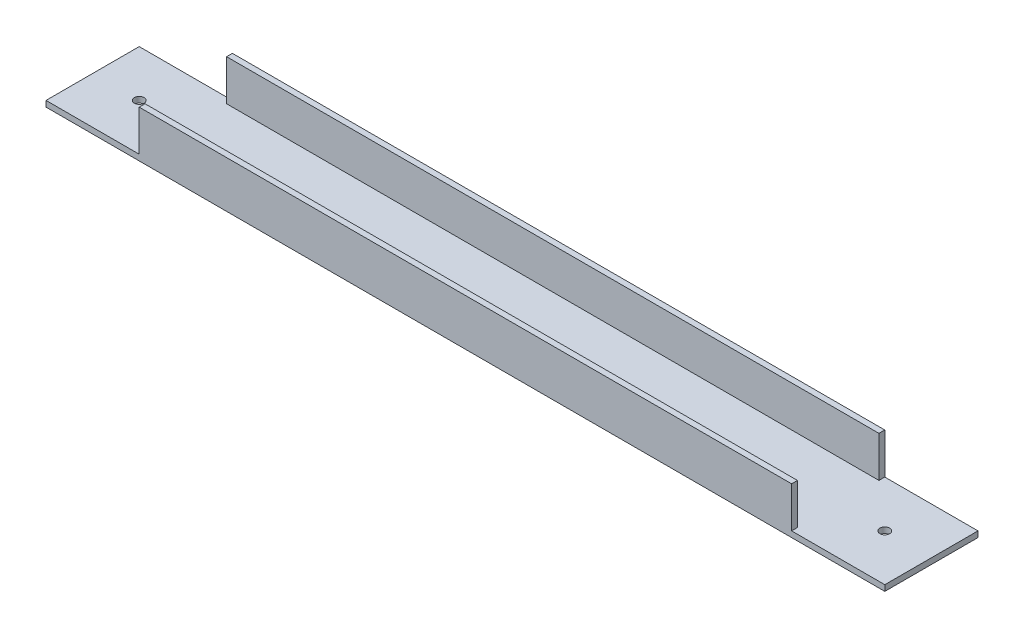
ISO-10303-21;
HEADER;
FILE_DESCRIPTION(('STEP AP214'),'2;1');
FILE_NAME('part.step','',(''),(''),'','','');
FILE_SCHEMA(('AUTOMOTIVE_DESIGN { 1 0 10303 214 1 1 1 1 }'));
ENDSEC;
DATA;
#1=APPLICATION_CONTEXT('core data for automotive mechanical design processes');
#2=APPLICATION_PROTOCOL_DEFINITION('international standard','automotive_design',2000,#1);
#3=PRODUCT_CONTEXT('',#1,'mechanical');
#4=PRODUCT('Part','Part','',(#3));
#5=PRODUCT_RELATED_PRODUCT_CATEGORY('part','',(#4));
#6=PRODUCT_DEFINITION_FORMATION('','',#4);
#7=PRODUCT_DEFINITION_CONTEXT('part definition',#1,'design');
#8=PRODUCT_DEFINITION('design','',#6,#7);
#9=PRODUCT_DEFINITION_SHAPE('','',#8);
#10=(LENGTH_UNIT() NAMED_UNIT(*) SI_UNIT(.MILLI.,.METRE.));
#11=(NAMED_UNIT(*) PLANE_ANGLE_UNIT() SI_UNIT($,.RADIAN.));
#12=(NAMED_UNIT(*) SI_UNIT($,.STERADIAN.) SOLID_ANGLE_UNIT());
#13=UNCERTAINTY_MEASURE_WITH_UNIT(LENGTH_MEASURE(1.E-05),#10,'distance_accuracy_value','');
#14=(GEOMETRIC_REPRESENTATION_CONTEXT(3) GLOBAL_UNCERTAINTY_ASSIGNED_CONTEXT((#13)) GLOBAL_UNIT_ASSIGNED_CONTEXT((#10,
#11,#12)) REPRESENTATION_CONTEXT('',''));
#15=CARTESIAN_POINT('',(0.,0.,0.));
#16=DIRECTION('',(0.,0.,1.));
#17=DIRECTION('',(1.,0.,0.));
#18=AXIS2_PLACEMENT_3D('',#15,#16,#17);
#19=CARTESIAN_POINT('',(457.2,0.,0.));
#20=DIRECTION('',(0.,0.,-1.));
#21=DIRECTION('',(-1.,0.,0.));
#22=AXIS2_PLACEMENT_3D('',#19,#20,#21);
#23=PLANE('',#22);
#24=DIRECTION('',(0.,1.,0.));
#25=VECTOR('',#24,1.);
#26=CARTESIAN_POINT('',(50.8,-68.6670489685532,0.));
#27=LINE('',#26,#25);
#28=CARTESIAN_POINT('',(50.8,3.17499999999997,0.));
#29=VERTEX_POINT('',#28);
#30=CARTESIAN_POINT('',(50.8,25.4,0.));
#31=VERTEX_POINT('',#30);
#32=EDGE_CURVE('E124',#29,#31,#27,.T.);
#33=ORIENTED_EDGE('',*,*,#32,.F.);
#34=DIRECTION('',(1.,0.,0.));
#35=VECTOR('',#34,1.);
#36=CARTESIAN_POINT('',(0.,3.175,0.));
#37=LINE('',#36,#35);
#38=CARTESIAN_POINT('',(0.,3.175,0.));
#39=VERTEX_POINT('',#38);
#40=EDGE_CURVE('E135',#39,#29,#37,.T.);
#41=ORIENTED_EDGE('',*,*,#40,.F.);
#42=DIRECTION('',(0.,-1.,0.));
#43=VECTOR('',#42,1.);
#44=CARTESIAN_POINT('',(0.,0.,0.));
#45=LINE('',#44,#43);
#46=CARTESIAN_POINT('',(0.,0.,0.));
#47=VERTEX_POINT('',#46);
#48=EDGE_CURVE('E176',#39,#47,#45,.T.);
#49=ORIENTED_EDGE('',*,*,#48,.T.);
#50=DIRECTION('',(-1.,0.,0.));
#51=VECTOR('',#50,1.);
#52=CARTESIAN_POINT('',(457.2,0.,0.));
#53=LINE('',#52,#51);
#54=CARTESIAN_POINT('',(457.2,0.,0.));
#55=VERTEX_POINT('',#54);
#56=EDGE_CURVE('E11',#55,#47,#53,.T.);
#57=ORIENTED_EDGE('',*,*,#56,.F.);
#58=DIRECTION('',(0.,-1.,0.));
#59=VECTOR('',#58,1.);
#60=CARTESIAN_POINT('',(457.2,0.,0.));
#61=LINE('',#60,#59);
#62=CARTESIAN_POINT('',(457.2,3.17499999999997,0.));
#63=VERTEX_POINT('',#62);
#64=EDGE_CURVE('E177',#63,#55,#61,.T.);
#65=ORIENTED_EDGE('',*,*,#64,.F.);
#66=DIRECTION('',(1.,0.,0.));
#67=VECTOR('',#66,1.);
#68=CARTESIAN_POINT('',(457.2,3.175,0.));
#69=LINE('',#68,#67);
#70=CARTESIAN_POINT('',(406.4,3.175,0.));
#71=VERTEX_POINT('',#70);
#72=EDGE_CURVE('E155',#71,#63,#69,.T.);
#73=ORIENTED_EDGE('',*,*,#72,.F.);
#74=DIRECTION('',(0.,1.,0.));
#75=VECTOR('',#74,1.);
#76=CARTESIAN_POINT('',(406.4,-68.6670489685532,0.));
#77=LINE('',#76,#75);
#78=CARTESIAN_POINT('',(406.4,25.4,0.));
#79=VERTEX_POINT('',#78);
#80=EDGE_CURVE('E158',#71,#79,#77,.T.);
#81=ORIENTED_EDGE('',*,*,#80,.T.);
#82=DIRECTION('',(-1.,0.,0.));
#83=VECTOR('',#82,1.);
#84=CARTESIAN_POINT('',(457.2,25.4,0.));
#85=LINE('',#84,#83);
#86=EDGE_CURVE('E144',#79,#31,#85,.T.);
#87=ORIENTED_EDGE('',*,*,#86,.T.);
#88=EDGE_LOOP('',(#33,#41,#49,#57,#65,#73,#81,#87));
#89=FACE_BOUND('',#88,.T.);
#90=ADVANCED_FACE('F32',(#89),#23,.F.);
#91=CARTESIAN_POINT('',(457.2,0.,0.));
#92=DIRECTION('',(0.,1.,0.));
#93=DIRECTION('',(0.,0.,1.));
#94=AXIS2_PLACEMENT_3D('',#91,#92,#93);
#95=PLANE('',#94);
#96=CARTESIAN_POINT('',(25.4,0.,-25.4));
#97=DIRECTION('',(0.,-1.,0.));
#98=DIRECTION('',(0.,0.,-1.));
#99=AXIS2_PLACEMENT_3D('',#96,#97,#98);
#100=CIRCLE('',#99,2.667);
#101=CARTESIAN_POINT('',(25.4,0.,-28.067));
#102=VERTEX_POINT('',#101);
#103=EDGE_CURVE('E307',#102,#102,#100,.T.);
#104=ORIENTED_EDGE('',*,*,#103,.F.);
#105=EDGE_LOOP('',(#104));
#106=FACE_BOUND('',#105,.T.);
#107=CARTESIAN_POINT('',(431.8,0.,-25.4));
#108=DIRECTION('',(0.,-1.,0.));
#109=DIRECTION('',(0.,0.,1.));
#110=AXIS2_PLACEMENT_3D('',#107,#108,#109);
#111=CIRCLE('',#110,2.66699999999997);
#112=CARTESIAN_POINT('',(431.8,0.,-22.733));
#113=VERTEX_POINT('',#112);
#114=EDGE_CURVE('E303',#113,#113,#111,.T.);
#115=ORIENTED_EDGE('',*,*,#114,.F.);
#116=EDGE_LOOP('',(#115));
#117=FACE_BOUND('',#116,.T.);
#118=DIRECTION('',(0.,0.,-1.));
#119=VECTOR('',#118,1.);
#120=CARTESIAN_POINT('',(0.,0.,0.));
#121=LINE('',#120,#119);
#122=CARTESIAN_POINT('',(0.,0.,-50.8));
#123=VERTEX_POINT('',#122);
#124=EDGE_CURVE('E185',#47,#123,#121,.T.);
#125=ORIENTED_EDGE('',*,*,#124,.T.);
#126=DIRECTION('',(-1.,0.,0.));
#127=VECTOR('',#126,1.);
#128=CARTESIAN_POINT('',(457.2,0.,-50.8));
#129=LINE('',#128,#127);
#130=CARTESIAN_POINT('',(457.2,0.,-50.8));
#131=VERTEX_POINT('',#130);
#132=EDGE_CURVE('E39',#131,#123,#129,.T.);
#133=ORIENTED_EDGE('',*,*,#132,.F.);
#134=DIRECTION('',(0.,0.,-1.));
#135=VECTOR('',#134,1.);
#136=CARTESIAN_POINT('',(457.2,0.,0.));
#137=LINE('',#136,#135);
#138=EDGE_CURVE('E179',#55,#131,#137,.T.);
#139=ORIENTED_EDGE('',*,*,#138,.F.);
#140=ORIENTED_EDGE('',*,*,#56,.T.);
#141=EDGE_LOOP('',(#125,#133,#139,#140));
#142=FACE_BOUND('',#141,.T.);
#143=ADVANCED_FACE('F216',(#106,#117,#142),#95,.F.);
#144=CARTESIAN_POINT('',(457.2,0.,-50.8));
#145=DIRECTION('',(0.,0.,1.));
#146=DIRECTION('',(1.,0.,0.));
#147=AXIS2_PLACEMENT_3D('',#144,#145,#146);
#148=PLANE('',#147);
#149=DIRECTION('',(0.,1.,0.));
#150=VECTOR('',#149,1.);
#151=CARTESIAN_POINT('',(0.,0.,-50.8));
#152=LINE('',#151,#150);
#153=CARTESIAN_POINT('',(0.,3.17499999999997,-50.8));
#154=VERTEX_POINT('',#153);
#155=EDGE_CURVE('E187',#123,#154,#152,.T.);
#156=ORIENTED_EDGE('',*,*,#155,.T.);
#157=DIRECTION('',(-1.,0.,0.));
#158=VECTOR('',#157,1.);
#159=CARTESIAN_POINT('',(0.,3.175,-50.8));
#160=LINE('',#159,#158);
#161=CARTESIAN_POINT('',(50.8,3.175,-50.8));
#162=VERTEX_POINT('',#161);
#163=EDGE_CURVE('E169',#162,#154,#160,.T.);
#164=ORIENTED_EDGE('',*,*,#163,.F.);
#165=DIRECTION('',(0.,1.,0.));
#166=VECTOR('',#165,1.);
#167=CARTESIAN_POINT('',(50.8,-68.6670489685532,-50.8));
#168=LINE('',#167,#166);
#169=CARTESIAN_POINT('',(50.8,25.4,-50.8));
#170=VERTEX_POINT('',#169);
#171=EDGE_CURVE('E131',#162,#170,#168,.T.);
#172=ORIENTED_EDGE('',*,*,#171,.T.);
#173=DIRECTION('',(-1.,0.,0.));
#174=VECTOR('',#173,1.);
#175=CARTESIAN_POINT('',(457.2,25.4,-50.8));
#176=LINE('',#175,#174);
#177=CARTESIAN_POINT('',(406.4,25.4,-50.8));
#178=VERTEX_POINT('',#177);
#179=EDGE_CURVE('E202',#178,#170,#176,.T.);
#180=ORIENTED_EDGE('',*,*,#179,.F.);
#181=DIRECTION('',(0.,1.,0.));
#182=VECTOR('',#181,1.);
#183=CARTESIAN_POINT('',(406.4,-68.6670489685532,-50.8));
#184=LINE('',#183,#182);
#185=CARTESIAN_POINT('',(406.4,3.17499999999997,-50.8));
#186=VERTEX_POINT('',#185);
#187=EDGE_CURVE('E154',#186,#178,#184,.T.);
#188=ORIENTED_EDGE('',*,*,#187,.F.);
#189=DIRECTION('',(-1.,0.,0.));
#190=VECTOR('',#189,1.);
#191=CARTESIAN_POINT('',(457.2,3.175,-50.8));
#192=LINE('',#191,#190);
#193=CARTESIAN_POINT('',(457.2,3.175,-50.8));
#194=VERTEX_POINT('',#193);
#195=EDGE_CURVE('E150',#194,#186,#192,.T.);
#196=ORIENTED_EDGE('',*,*,#195,.F.);
#197=DIRECTION('',(0.,1.,0.));
#198=VECTOR('',#197,1.);
#199=CARTESIAN_POINT('',(457.2,0.,-50.8));
#200=LINE('',#199,#198);
#201=EDGE_CURVE('E181',#131,#194,#200,.T.);
#202=ORIENTED_EDGE('',*,*,#201,.F.);
#203=ORIENTED_EDGE('',*,*,#132,.T.);
#204=EDGE_LOOP('',(#156,#164,#172,#180,#188,#196,#202,#203));
#205=FACE_BOUND('',#204,.T.);
#206=ADVANCED_FACE('F208',(#205),#148,.F.);
#207=CARTESIAN_POINT('',(457.2,25.4,-50.8));
#208=DIRECTION('',(0.,-1.,0.));
#209=DIRECTION('',(0.,0.,-1.));
#210=AXIS2_PLACEMENT_3D('',#207,#208,#209);
#211=PLANE('',#210);
#212=ORIENTED_EDGE('',*,*,#179,.T.);
#213=DIRECTION('',(0.,0.,-1.));
#214=VECTOR('',#213,1.);
#215=CARTESIAN_POINT('',(50.8,25.4,0.));
#216=LINE('',#215,#214);
#217=CARTESIAN_POINT('',(50.8,25.4,-47.625));
#218=VERTEX_POINT('',#217);
#219=EDGE_CURVE('E157',#218,#170,#216,.T.);
#220=ORIENTED_EDGE('',*,*,#219,.F.);
#221=DIRECTION('',(-1.,0.,0.));
#222=VECTOR('',#221,1.);
#223=CARTESIAN_POINT('',(457.2,25.4,-47.625));
#224=LINE('',#223,#222);
#225=CARTESIAN_POINT('',(406.4,25.4,-47.625));
#226=VERTEX_POINT('',#225);
#227=EDGE_CURVE('E199',#226,#218,#224,.T.);
#228=ORIENTED_EDGE('',*,*,#227,.F.);
#229=DIRECTION('',(0.,0.,1.));
#230=VECTOR('',#229,1.);
#231=CARTESIAN_POINT('',(406.4,25.4,0.));
#232=LINE('',#231,#230);
#233=EDGE_CURVE('E148',#178,#226,#232,.T.);
#234=ORIENTED_EDGE('',*,*,#233,.F.);
#235=EDGE_LOOP('',(#212,#220,#228,#234));
#236=FACE_BOUND('',#235,.T.);
#237=ADVANCED_FACE('F240',(#236),#211,.F.);
#238=CARTESIAN_POINT('',(457.2,3.175,-47.625));
#239=DIRECTION('',(0.,0.,-1.));
#240=DIRECTION('',(-1.,0.,0.));
#241=AXIS2_PLACEMENT_3D('',#238,#239,#240);
#242=PLANE('',#241);
#243=ORIENTED_EDGE('',*,*,#227,.T.);
#244=DIRECTION('',(0.,-1.,0.));
#245=VECTOR('',#244,1.);
#246=CARTESIAN_POINT('',(50.8,3.175,-47.625));
#247=LINE('',#246,#245);
#248=CARTESIAN_POINT('',(50.8,3.175,-47.625));
#249=VERTEX_POINT('',#248);
#250=EDGE_CURVE('E173',#218,#249,#247,.T.);
#251=ORIENTED_EDGE('',*,*,#250,.T.);
#252=DIRECTION('',(-1.,0.,0.));
#253=VECTOR('',#252,1.);
#254=CARTESIAN_POINT('',(457.2,3.175,-47.625));
#255=LINE('',#254,#253);
#256=CARTESIAN_POINT('',(406.4,3.175,-47.625));
#257=VERTEX_POINT('',#256);
#258=EDGE_CURVE('E197',#257,#249,#255,.T.);
#259=ORIENTED_EDGE('',*,*,#258,.F.);
#260=DIRECTION('',(0.,1.,0.));
#261=VECTOR('',#260,1.);
#262=CARTESIAN_POINT('',(406.4,3.175,-47.625));
#263=LINE('',#262,#261);
#264=EDGE_CURVE('E168',#257,#226,#263,.T.);
#265=ORIENTED_EDGE('',*,*,#264,.T.);
#266=EDGE_LOOP('',(#243,#251,#259,#265));
#267=FACE_BOUND('',#266,.T.);
#268=ADVANCED_FACE('F247',(#267),#242,.F.);
#269=CARTESIAN_POINT('',(457.2,3.175,-3.175));
#270=DIRECTION('',(0.,-1.,0.));
#271=DIRECTION('',(0.,0.,-1.));
#272=AXIS2_PLACEMENT_3D('',#269,#270,#271);
#273=PLANE('',#272);
#274=CARTESIAN_POINT('',(25.4,3.175,-25.4));
#275=DIRECTION('',(0.,-1.,0.));
#276=DIRECTION('',(0.,0.,-1.));
#277=AXIS2_PLACEMENT_3D('',#274,#275,#276);
#278=CIRCLE('',#277,2.667);
#279=CARTESIAN_POINT('',(25.4,3.175,-28.067));
#280=VERTEX_POINT('',#279);
#281=EDGE_CURVE('E309',#280,#280,#278,.F.);
#282=ORIENTED_EDGE('',*,*,#281,.F.);
#283=EDGE_LOOP('',(#282));
#284=FACE_BOUND('',#283,.T.);
#285=CARTESIAN_POINT('',(431.8,3.175,-25.4));
#286=DIRECTION('',(0.,-1.,0.));
#287=DIRECTION('',(0.,0.,-1.));
#288=AXIS2_PLACEMENT_3D('',#285,#286,#287);
#289=CIRCLE('',#288,2.66699999999997);
#290=CARTESIAN_POINT('',(431.8,3.175,-28.067));
#291=VERTEX_POINT('',#290);
#292=EDGE_CURVE('E266',#291,#291,#289,.F.);
#293=ORIENTED_EDGE('',*,*,#292,.F.);
#294=EDGE_LOOP('',(#293));
#295=FACE_BOUND('',#294,.T.);
#296=ORIENTED_EDGE('',*,*,#258,.T.);
#297=DIRECTION('',(0.,0.,-1.));
#298=VECTOR('',#297,1.);
#299=CARTESIAN_POINT('',(50.8,3.175,0.));
#300=LINE('',#299,#298);
#301=EDGE_CURVE('E132',#249,#162,#300,.T.);
#302=ORIENTED_EDGE('',*,*,#301,.T.);
#303=ORIENTED_EDGE('',*,*,#163,.T.);
#304=DIRECTION('',(0.,0.,1.));
#305=VECTOR('',#304,1.);
#306=CARTESIAN_POINT('',(0.,3.175,-3.175));
#307=LINE('',#306,#305);
#308=EDGE_CURVE('E54',#154,#39,#307,.T.);
#309=ORIENTED_EDGE('',*,*,#308,.T.);
#310=ORIENTED_EDGE('',*,*,#40,.T.);
#311=CARTESIAN_POINT('',(50.8,3.175,-3.175));
#312=VERTEX_POINT('',#311);
#313=EDGE_CURVE('E120',#29,#312,#300,.T.);
#314=ORIENTED_EDGE('',*,*,#313,.T.);
#315=DIRECTION('',(-1.,0.,0.));
#316=VECTOR('',#315,1.);
#317=CARTESIAN_POINT('',(457.2,3.175,-3.175));
#318=LINE('',#317,#316);
#319=CARTESIAN_POINT('',(406.4,3.175,-3.175));
#320=VERTEX_POINT('',#319);
#321=EDGE_CURVE('E195',#320,#312,#318,.T.);
#322=ORIENTED_EDGE('',*,*,#321,.F.);
#323=DIRECTION('',(0.,0.,1.));
#324=VECTOR('',#323,1.);
#325=CARTESIAN_POINT('',(406.4,3.175,0.));
#326=LINE('',#325,#324);
#327=EDGE_CURVE('E162',#320,#71,#326,.T.);
#328=ORIENTED_EDGE('',*,*,#327,.T.);
#329=ORIENTED_EDGE('',*,*,#72,.T.);
#330=DIRECTION('',(0.,0.,1.));
#331=VECTOR('',#330,1.);
#332=CARTESIAN_POINT('',(457.2,3.175,-3.175));
#333=LINE('',#332,#331);
#334=EDGE_CURVE('E46',#194,#63,#333,.T.);
#335=ORIENTED_EDGE('',*,*,#334,.F.);
#336=ORIENTED_EDGE('',*,*,#195,.T.);
#337=EDGE_CURVE('E159',#186,#257,#326,.T.);
#338=ORIENTED_EDGE('',*,*,#337,.T.);
#339=EDGE_LOOP('',(#296,#302,#303,#309,#310,#314,#322,#328,#329,#335,#336,#338));
#340=FACE_BOUND('',#339,.T.);
#341=ADVANCED_FACE('F137',(#284,#295,#340),#273,.F.);
#342=CARTESIAN_POINT('',(457.2,3.175,-3.175));
#343=DIRECTION('',(0.,0.,1.));
#344=DIRECTION('',(1.,0.,0.));
#345=AXIS2_PLACEMENT_3D('',#342,#343,#344);
#346=PLANE('',#345);
#347=ORIENTED_EDGE('',*,*,#321,.T.);
#348=DIRECTION('',(0.,1.,0.));
#349=VECTOR('',#348,1.);
#350=CARTESIAN_POINT('',(50.8,3.175,-3.175));
#351=LINE('',#350,#349);
#352=CARTESIAN_POINT('',(50.8,25.4,-3.175));
#353=VERTEX_POINT('',#352);
#354=EDGE_CURVE('E127',#312,#353,#351,.T.);
#355=ORIENTED_EDGE('',*,*,#354,.T.);
#356=DIRECTION('',(-1.,0.,0.));
#357=VECTOR('',#356,1.);
#358=CARTESIAN_POINT('',(457.2,25.4,-3.175));
#359=LINE('',#358,#357);
#360=CARTESIAN_POINT('',(406.4,25.4,-3.175));
#361=VERTEX_POINT('',#360);
#362=EDGE_CURVE('E192',#361,#353,#359,.T.);
#363=ORIENTED_EDGE('',*,*,#362,.F.);
#364=DIRECTION('',(0.,-1.,0.));
#365=VECTOR('',#364,1.);
#366=CARTESIAN_POINT('',(406.4,3.175,-3.175));
#367=LINE('',#366,#365);
#368=EDGE_CURVE('E165',#361,#320,#367,.T.);
#369=ORIENTED_EDGE('',*,*,#368,.T.);
#370=EDGE_LOOP('',(#347,#355,#363,#369));
#371=FACE_BOUND('',#370,.T.);
#372=ADVANCED_FACE('F228',(#371),#346,.F.);
#373=CARTESIAN_POINT('',(457.2,25.4,0.));
#374=DIRECTION('',(0.,-1.,0.));
#375=DIRECTION('',(0.,0.,-1.));
#376=AXIS2_PLACEMENT_3D('',#373,#374,#375);
#377=PLANE('',#376);
#378=ORIENTED_EDGE('',*,*,#362,.T.);
#379=EDGE_CURVE('E139',#31,#353,#216,.T.);
#380=ORIENTED_EDGE('',*,*,#379,.F.);
#381=ORIENTED_EDGE('',*,*,#86,.F.);
#382=EDGE_CURVE('E151',#361,#79,#232,.T.);
#383=ORIENTED_EDGE('',*,*,#382,.F.);
#384=EDGE_LOOP('',(#378,#380,#381,#383));
#385=FACE_BOUND('',#384,.T.);
#386=ADVANCED_FACE('F221',(#385),#377,.F.);
#387=CARTESIAN_POINT('',(457.2,0.,0.));
#388=DIRECTION('',(-1.,0.,0.));
#389=DIRECTION('',(0.,0.,1.));
#390=AXIS2_PLACEMENT_3D('',#387,#388,#389);
#391=PLANE('',#390);
#392=ORIENTED_EDGE('',*,*,#201,.T.);
#393=ORIENTED_EDGE('',*,*,#334,.T.);
#394=ORIENTED_EDGE('',*,*,#64,.T.);
#395=ORIENTED_EDGE('',*,*,#138,.T.);
#396=EDGE_LOOP('',(#392,#393,#394,#395));
#397=FACE_BOUND('',#396,.T.);
#398=ADVANCED_FACE('F219',(#397),#391,.F.);
#399=CARTESIAN_POINT('',(0.,0.,0.));
#400=DIRECTION('',(-1.,0.,0.));
#401=DIRECTION('',(0.,0.,1.));
#402=AXIS2_PLACEMENT_3D('',#399,#400,#401);
#403=PLANE('',#402);
#404=ORIENTED_EDGE('',*,*,#308,.F.);
#405=ORIENTED_EDGE('',*,*,#155,.F.);
#406=ORIENTED_EDGE('',*,*,#124,.F.);
#407=ORIENTED_EDGE('',*,*,#48,.F.);
#408=EDGE_LOOP('',(#404,#405,#406,#407));
#409=FACE_BOUND('',#408,.T.);
#410=ADVANCED_FACE('F214',(#409),#403,.T.);
#411=CARTESIAN_POINT('',(50.8,-68.6670489685532,0.));
#412=DIRECTION('',(1.,0.,0.));
#413=DIRECTION('',(0.,0.,-1.));
#414=AXIS2_PLACEMENT_3D('',#411,#412,#413);
#415=PLANE('',#414);
#416=ORIENTED_EDGE('',*,*,#313,.F.);
#417=ORIENTED_EDGE('',*,*,#32,.T.);
#418=ORIENTED_EDGE('',*,*,#379,.T.);
#419=ORIENTED_EDGE('',*,*,#354,.F.);
#420=EDGE_LOOP('',(#416,#417,#418,#419));
#421=FACE_BOUND('',#420,.T.);
#422=ADVANCED_FACE('F122',(#421),#415,.F.);
#423=ORIENTED_EDGE('',*,*,#219,.T.);
#424=ORIENTED_EDGE('',*,*,#171,.F.);
#425=ORIENTED_EDGE('',*,*,#301,.F.);
#426=ORIENTED_EDGE('',*,*,#250,.F.);
#427=EDGE_LOOP('',(#423,#424,#425,#426));
#428=FACE_BOUND('',#427,.T.);
#429=ADVANCED_FACE('F280',(#428),#415,.F.);
#430=CARTESIAN_POINT('',(406.4,-68.6670489685532,0.));
#431=DIRECTION('',(-1.,0.,0.));
#432=DIRECTION('',(0.,0.,1.));
#433=AXIS2_PLACEMENT_3D('',#430,#431,#432);
#434=PLANE('',#433);
#435=ORIENTED_EDGE('',*,*,#382,.T.);
#436=ORIENTED_EDGE('',*,*,#80,.F.);
#437=ORIENTED_EDGE('',*,*,#327,.F.);
#438=ORIENTED_EDGE('',*,*,#368,.F.);
#439=EDGE_LOOP('',(#435,#436,#437,#438));
#440=FACE_BOUND('',#439,.T.);
#441=ADVANCED_FACE('F262',(#440),#434,.F.);
#442=ORIENTED_EDGE('',*,*,#337,.F.);
#443=ORIENTED_EDGE('',*,*,#187,.T.);
#444=ORIENTED_EDGE('',*,*,#233,.T.);
#445=ORIENTED_EDGE('',*,*,#264,.F.);
#446=EDGE_LOOP('',(#442,#443,#444,#445));
#447=FACE_BOUND('',#446,.T.);
#448=ADVANCED_FACE('F278',(#447),#434,.F.);
#449=CARTESIAN_POINT('',(431.8,25.401,-25.4));
#450=DIRECTION('',(0.,-1.,0.));
#451=DIRECTION('',(0.,0.,-1.));
#452=AXIS2_PLACEMENT_3D('',#449,#450,#451);
#453=CYLINDRICAL_SURFACE('',#452,2.66699999999997);
#454=ORIENTED_EDGE('',*,*,#114,.T.);
#455=EDGE_LOOP('',(#454));
#456=FACE_BOUND('',#455,.T.);
#457=ORIENTED_EDGE('',*,*,#292,.T.);
#458=EDGE_LOOP('',(#457));
#459=FACE_BOUND('',#458,.T.);
#460=ADVANCED_FACE('F288',(#456,#459),#453,.F.);
#461=CARTESIAN_POINT('',(25.4,25.401,-25.4));
#462=DIRECTION('',(0.,-1.,0.));
#463=DIRECTION('',(0.,0.,-1.));
#464=AXIS2_PLACEMENT_3D('',#461,#462,#463);
#465=CYLINDRICAL_SURFACE('',#464,2.667);
#466=ORIENTED_EDGE('',*,*,#103,.T.);
#467=EDGE_LOOP('',(#466));
#468=FACE_BOUND('',#467,.T.);
#469=ORIENTED_EDGE('',*,*,#281,.T.);
#470=EDGE_LOOP('',(#469));
#471=FACE_BOUND('',#470,.T.);
#472=ADVANCED_FACE('F294',(#468,#471),#465,.F.);
#473=CLOSED_SHELL('',(#90,#143,#206,#237,#268,#341,#372,#386,#398,#410,#422,#429,#441,#448,#460,#472));
#474=MANIFOLD_SOLID_BREP('B2',#473);
#475=ADVANCED_BREP_SHAPE_REPRESENTATION('',(#18,#474),#14);
#476=SHAPE_DEFINITION_REPRESENTATION(#9,#475);
ENDSEC;
END-ISO-10303-21;
